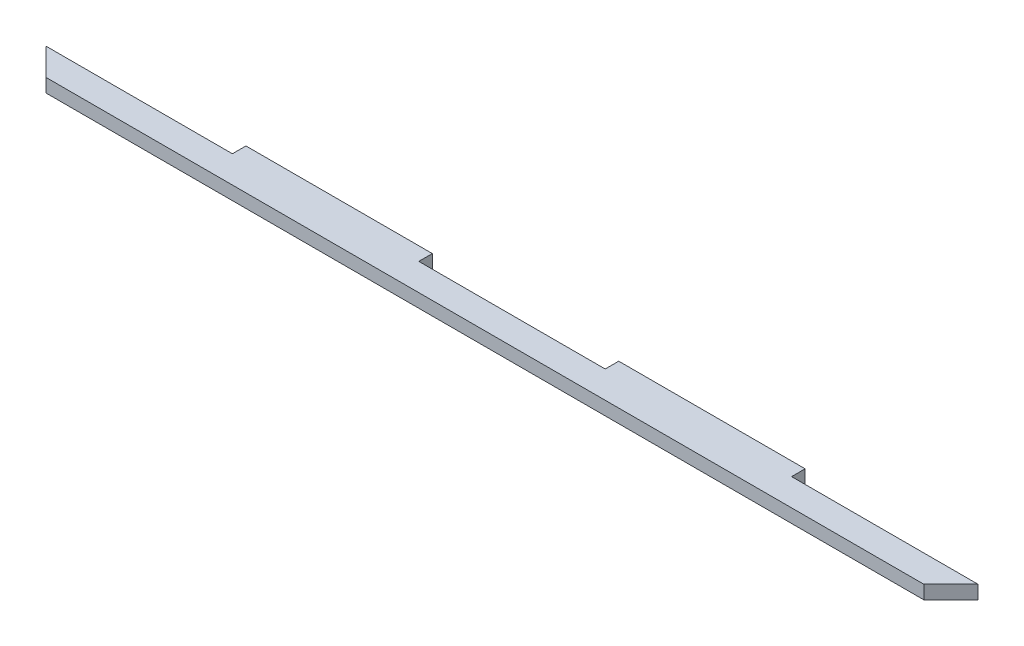
ISO-10303-21;
HEADER;
FILE_DESCRIPTION(('STEP AP214'),'2;1');
FILE_NAME('part.step','',(''),(''),'','','');
FILE_SCHEMA(('AUTOMOTIVE_DESIGN { 1 0 10303 214 1 1 1 1 }'));
ENDSEC;
DATA;
#1=APPLICATION_CONTEXT('core data for automotive mechanical design processes');
#2=APPLICATION_PROTOCOL_DEFINITION('international standard','automotive_design',2000,#1);
#3=PRODUCT_CONTEXT('',#1,'mechanical');
#4=PRODUCT('Part','Part','',(#3));
#5=PRODUCT_RELATED_PRODUCT_CATEGORY('part','',(#4));
#6=PRODUCT_DEFINITION_FORMATION('','',#4);
#7=PRODUCT_DEFINITION_CONTEXT('part definition',#1,'design');
#8=PRODUCT_DEFINITION('design','',#6,#7);
#9=PRODUCT_DEFINITION_SHAPE('','',#8);
#10=(LENGTH_UNIT() NAMED_UNIT(*) SI_UNIT(.MILLI.,.METRE.));
#11=(NAMED_UNIT(*) PLANE_ANGLE_UNIT() SI_UNIT($,.RADIAN.));
#12=(NAMED_UNIT(*) SI_UNIT($,.STERADIAN.) SOLID_ANGLE_UNIT());
#13=UNCERTAINTY_MEASURE_WITH_UNIT(LENGTH_MEASURE(1.E-05),#10,'distance_accuracy_value','');
#14=(GEOMETRIC_REPRESENTATION_CONTEXT(3) GLOBAL_UNCERTAINTY_ASSIGNED_CONTEXT((#13)) GLOBAL_UNIT_ASSIGNED_CONTEXT((#10,
#11,#12)) REPRESENTATION_CONTEXT('',''));
#15=CARTESIAN_POINT('',(0.,0.,0.));
#16=DIRECTION('',(0.,0.,1.));
#17=DIRECTION('',(1.,0.,0.));
#18=AXIS2_PLACEMENT_3D('',#15,#16,#17);
#19=CARTESIAN_POINT('',(-61.95,3.,-4.5));
#20=DIRECTION('',(1.,0.,0.));
#21=DIRECTION('',(0.,0.,-1.));
#22=AXIS2_PLACEMENT_3D('',#19,#20,#21);
#23=PLANE('',#22);
#24=DIRECTION('',(0.,0.,1.));
#25=VECTOR('',#24,1.);
#26=CARTESIAN_POINT('',(-61.95,0.,-4.5));
#27=LINE('',#26,#25);
#28=CARTESIAN_POINT('',(-61.95,0.,-4.5));
#29=VERTEX_POINT('',#28);
#30=CARTESIAN_POINT('',(-61.95,0.,-1.5));
#31=VERTEX_POINT('',#30);
#32=EDGE_CURVE('E154',#29,#31,#27,.T.);
#33=ORIENTED_EDGE('',*,*,#32,.T.);
#34=DIRECTION('',(0.,-1.,0.));
#35=VECTOR('',#34,1.);
#36=CARTESIAN_POINT('',(-61.95,3.,-1.5));
#37=LINE('',#36,#35);
#38=CARTESIAN_POINT('',(-61.95,3.,-1.5));
#39=VERTEX_POINT('',#38);
#40=EDGE_CURVE('E11',#39,#31,#37,.T.);
#41=ORIENTED_EDGE('',*,*,#40,.F.);
#42=DIRECTION('',(0.,0.,1.));
#43=VECTOR('',#42,1.);
#44=CARTESIAN_POINT('',(-61.95,3.,-4.5));
#45=LINE('',#44,#43);
#46=CARTESIAN_POINT('',(-61.95,3.,-4.5));
#47=VERTEX_POINT('',#46);
#48=EDGE_CURVE('E176',#47,#39,#45,.T.);
#49=ORIENTED_EDGE('',*,*,#48,.F.);
#50=DIRECTION('',(0.,-1.,0.));
#51=VECTOR('',#50,1.);
#52=CARTESIAN_POINT('',(-61.95,3.,-4.5));
#53=LINE('',#52,#51);
#54=EDGE_CURVE('E150',#47,#29,#53,.T.);
#55=ORIENTED_EDGE('',*,*,#54,.T.);
#56=EDGE_LOOP('',(#33,#41,#49,#55));
#57=FACE_BOUND('',#56,.T.);
#58=ADVANCED_FACE('F34',(#57),#23,.F.);
#59=CARTESIAN_POINT('',(-103.25,3.,-1.5));
#60=DIRECTION('',(0.,0.,1.));
#61=DIRECTION('',(1.,0.,0.));
#62=AXIS2_PLACEMENT_3D('',#59,#60,#61);
#63=PLANE('',#62);
#64=DIRECTION('',(-1.,0.,0.));
#65=VECTOR('',#64,1.);
#66=CARTESIAN_POINT('',(-103.25,0.,-1.5));
#67=LINE('',#66,#65);
#68=CARTESIAN_POINT('',(-103.25,0.,-1.5));
#69=VERTEX_POINT('',#68);
#70=EDGE_CURVE('E157',#31,#69,#67,.T.);
#71=ORIENTED_EDGE('',*,*,#70,.T.);
#72=DIRECTION('',(0.,-1.,0.));
#73=VECTOR('',#72,1.);
#74=CARTESIAN_POINT('',(-103.25,3.,-1.5));
#75=LINE('',#74,#73);
#76=CARTESIAN_POINT('',(-103.25,3.,-1.5));
#77=VERTEX_POINT('',#76);
#78=EDGE_CURVE('E42',#77,#69,#75,.T.);
#79=ORIENTED_EDGE('',*,*,#78,.F.);
#80=DIRECTION('',(-1.,0.,0.));
#81=VECTOR('',#80,1.);
#82=CARTESIAN_POINT('',(-103.25,3.,-1.5));
#83=LINE('',#82,#81);
#84=EDGE_CURVE('E105',#39,#77,#83,.T.);
#85=ORIENTED_EDGE('',*,*,#84,.F.);
#86=ORIENTED_EDGE('',*,*,#40,.T.);
#87=EDGE_LOOP('',(#71,#79,#85,#86));
#88=FACE_BOUND('',#87,.T.);
#89=ADVANCED_FACE('F254',(#88),#63,.F.);
#90=CARTESIAN_POINT('',(-103.25,3.,-1.5));
#91=DIRECTION('',(0.707106781186539,0.,-0.707106781186556));
#92=DIRECTION('',(-0.707106781186556,0.,-0.707106781186539));
#93=AXIS2_PLACEMENT_3D('',#90,#91,#92);
#94=PLANE('',#93);
#95=DIRECTION('',(0.707106781186556,0.,0.707106781186539));
#96=VECTOR('',#95,1.);
#97=CARTESIAN_POINT('',(-103.25,0.,-1.5));
#98=LINE('',#97,#96);
#99=CARTESIAN_POINT('',(-97.2499999999998,0.,4.5));
#100=VERTEX_POINT('',#99);
#101=EDGE_CURVE('E159',#69,#100,#98,.T.);
#102=ORIENTED_EDGE('',*,*,#101,.T.);
#103=DIRECTION('',(0.,-1.,0.));
#104=VECTOR('',#103,1.);
#105=CARTESIAN_POINT('',(-97.2499999999998,3.,4.5));
#106=LINE('',#105,#104);
#107=CARTESIAN_POINT('',(-97.2499999999998,3.,4.5));
#108=VERTEX_POINT('',#107);
#109=EDGE_CURVE('E195',#108,#100,#106,.T.);
#110=ORIENTED_EDGE('',*,*,#109,.F.);
#111=DIRECTION('',(0.707106781186556,0.,0.707106781186539));
#112=VECTOR('',#111,1.);
#113=CARTESIAN_POINT('',(-103.25,3.,-1.5));
#114=LINE('',#113,#112);
#115=EDGE_CURVE('E203',#77,#108,#114,.T.);
#116=ORIENTED_EDGE('',*,*,#115,.F.);
#117=ORIENTED_EDGE('',*,*,#78,.T.);
#118=EDGE_LOOP('',(#102,#110,#116,#117));
#119=FACE_BOUND('',#118,.T.);
#120=ADVANCED_FACE('F201',(#119),#94,.F.);
#121=CARTESIAN_POINT('',(-97.2499999999998,3.,4.5));
#122=DIRECTION('',(0.,0.,-1.));
#123=DIRECTION('',(-1.,0.,0.));
#124=AXIS2_PLACEMENT_3D('',#121,#122,#123);
#125=PLANE('',#124);
#126=DIRECTION('',(1.,0.,0.));
#127=VECTOR('',#126,1.);
#128=CARTESIAN_POINT('',(-97.2499999999998,0.,4.5));
#129=LINE('',#128,#127);
#130=CARTESIAN_POINT('',(97.2500000000001,0.,4.50000000000001));
#131=VERTEX_POINT('',#130);
#132=EDGE_CURVE('E161',#100,#131,#129,.T.);
#133=ORIENTED_EDGE('',*,*,#132,.T.);
#134=DIRECTION('',(0.,-1.,0.));
#135=VECTOR('',#134,1.);
#136=CARTESIAN_POINT('',(97.2500000000001,3.,4.50000000000001));
#137=LINE('',#136,#135);
#138=CARTESIAN_POINT('',(97.2500000000001,3.,4.50000000000001));
#139=VERTEX_POINT('',#138);
#140=EDGE_CURVE('E192',#139,#131,#137,.T.);
#141=ORIENTED_EDGE('',*,*,#140,.F.);
#142=DIRECTION('',(1.,0.,0.));
#143=VECTOR('',#142,1.);
#144=CARTESIAN_POINT('',(-97.2499999999998,3.,4.5));
#145=LINE('',#144,#143);
#146=EDGE_CURVE('E221',#108,#139,#145,.T.);
#147=ORIENTED_EDGE('',*,*,#146,.F.);
#148=ORIENTED_EDGE('',*,*,#109,.T.);
#149=EDGE_LOOP('',(#133,#141,#147,#148));
#150=FACE_BOUND('',#149,.T.);
#151=ADVANCED_FACE('F212',(#150),#125,.F.);
#152=CARTESIAN_POINT('',(103.25,3.,-1.5));
#153=DIRECTION('',(-0.707106781186551,0.,-0.707106781186544));
#154=DIRECTION('',(-0.707106781186544,0.,0.707106781186551));
#155=AXIS2_PLACEMENT_3D('',#152,#153,#154);
#156=PLANE('',#155);
#157=DIRECTION('',(0.707106781186544,0.,-0.707106781186551));
#158=VECTOR('',#157,1.);
#159=CARTESIAN_POINT('',(103.25,0.,-1.5));
#160=LINE('',#159,#158);
#161=CARTESIAN_POINT('',(103.25,0.,-1.5));
#162=VERTEX_POINT('',#161);
#163=EDGE_CURVE('E163',#131,#162,#160,.T.);
#164=ORIENTED_EDGE('',*,*,#163,.T.);
#165=DIRECTION('',(0.,-1.,0.));
#166=VECTOR('',#165,1.);
#167=CARTESIAN_POINT('',(103.25,3.,-1.5));
#168=LINE('',#167,#166);
#169=CARTESIAN_POINT('',(103.25,3.,-1.5));
#170=VERTEX_POINT('',#169);
#171=EDGE_CURVE('E189',#170,#162,#168,.T.);
#172=ORIENTED_EDGE('',*,*,#171,.F.);
#173=DIRECTION('',(0.707106781186544,0.,-0.707106781186551));
#174=VECTOR('',#173,1.);
#175=CARTESIAN_POINT('',(103.25,3.,-1.5));
#176=LINE('',#175,#174);
#177=EDGE_CURVE('E218',#139,#170,#176,.T.);
#178=ORIENTED_EDGE('',*,*,#177,.F.);
#179=ORIENTED_EDGE('',*,*,#140,.T.);
#180=EDGE_LOOP('',(#164,#172,#178,#179));
#181=FACE_BOUND('',#180,.T.);
#182=ADVANCED_FACE('F216',(#181),#156,.F.);
#183=CARTESIAN_POINT('',(61.9499999999999,3.,-1.5));
#184=DIRECTION('',(0.,0.,1.));
#185=DIRECTION('',(1.,0.,0.));
#186=AXIS2_PLACEMENT_3D('',#183,#184,#185);
#187=PLANE('',#186);
#188=DIRECTION('',(-1.,0.,0.));
#189=VECTOR('',#188,1.);
#190=CARTESIAN_POINT('',(61.9499999999999,0.,-1.5));
#191=LINE('',#190,#189);
#192=CARTESIAN_POINT('',(61.9499999999999,0.,-1.5));
#193=VERTEX_POINT('',#192);
#194=EDGE_CURVE('E165',#162,#193,#191,.T.);
#195=ORIENTED_EDGE('',*,*,#194,.T.);
#196=DIRECTION('',(0.,-1.,0.));
#197=VECTOR('',#196,1.);
#198=CARTESIAN_POINT('',(61.9499999999999,3.,-1.5));
#199=LINE('',#198,#197);
#200=CARTESIAN_POINT('',(61.9499999999999,3.,-1.5));
#201=VERTEX_POINT('',#200);
#202=EDGE_CURVE('E186',#201,#193,#199,.T.);
#203=ORIENTED_EDGE('',*,*,#202,.F.);
#204=DIRECTION('',(-1.,0.,0.));
#205=VECTOR('',#204,1.);
#206=CARTESIAN_POINT('',(61.9499999999999,3.,-1.5));
#207=LINE('',#206,#205);
#208=EDGE_CURVE('E220',#170,#201,#207,.T.);
#209=ORIENTED_EDGE('',*,*,#208,.F.);
#210=ORIENTED_EDGE('',*,*,#171,.T.);
#211=EDGE_LOOP('',(#195,#203,#209,#210));
#212=FACE_BOUND('',#211,.T.);
#213=ADVANCED_FACE('F267',(#212),#187,.F.);
#214=CARTESIAN_POINT('',(61.95,3.,-4.5));
#215=DIRECTION('',(-1.,0.,0.));
#216=DIRECTION('',(0.,0.,1.));
#217=AXIS2_PLACEMENT_3D('',#214,#215,#216);
#218=PLANE('',#217);
#219=DIRECTION('',(0.,0.,-1.));
#220=VECTOR('',#219,1.);
#221=CARTESIAN_POINT('',(61.95,0.,-4.5));
#222=LINE('',#221,#220);
#223=CARTESIAN_POINT('',(61.95,0.,-4.5));
#224=VERTEX_POINT('',#223);
#225=EDGE_CURVE('E167',#193,#224,#222,.T.);
#226=ORIENTED_EDGE('',*,*,#225,.T.);
#227=DIRECTION('',(0.,-1.,0.));
#228=VECTOR('',#227,1.);
#229=CARTESIAN_POINT('',(61.95,3.,-4.5));
#230=LINE('',#229,#228);
#231=CARTESIAN_POINT('',(61.95,3.,-4.5));
#232=VERTEX_POINT('',#231);
#233=EDGE_CURVE('E183',#232,#224,#230,.T.);
#234=ORIENTED_EDGE('',*,*,#233,.F.);
#235=DIRECTION('',(0.,0.,-1.));
#236=VECTOR('',#235,1.);
#237=CARTESIAN_POINT('',(61.95,3.,-4.5));
#238=LINE('',#237,#236);
#239=EDGE_CURVE('E223',#201,#232,#238,.T.);
#240=ORIENTED_EDGE('',*,*,#239,.F.);
#241=ORIENTED_EDGE('',*,*,#202,.T.);
#242=EDGE_LOOP('',(#226,#234,#240,#241));
#243=FACE_BOUND('',#242,.T.);
#244=ADVANCED_FACE('F270',(#243),#218,.F.);
#245=CARTESIAN_POINT('',(20.65,3.,-4.5));
#246=DIRECTION('',(0.,0.,1.));
#247=DIRECTION('',(1.,0.,0.));
#248=AXIS2_PLACEMENT_3D('',#245,#246,#247);
#249=PLANE('',#248);
#250=DIRECTION('',(-1.,0.,0.));
#251=VECTOR('',#250,1.);
#252=CARTESIAN_POINT('',(20.65,0.,-4.5));
#253=LINE('',#252,#251);
#254=CARTESIAN_POINT('',(20.65,0.,-4.5));
#255=VERTEX_POINT('',#254);
#256=EDGE_CURVE('E169',#224,#255,#253,.T.);
#257=ORIENTED_EDGE('',*,*,#256,.T.);
#258=DIRECTION('',(0.,-1.,0.));
#259=VECTOR('',#258,1.);
#260=CARTESIAN_POINT('',(20.65,3.,-4.5));
#261=LINE('',#260,#259);
#262=CARTESIAN_POINT('',(20.65,3.,-4.5));
#263=VERTEX_POINT('',#262);
#264=EDGE_CURVE('E180',#263,#255,#261,.T.);
#265=ORIENTED_EDGE('',*,*,#264,.F.);
#266=DIRECTION('',(-1.,0.,0.));
#267=VECTOR('',#266,1.);
#268=CARTESIAN_POINT('',(20.65,3.,-4.5));
#269=LINE('',#268,#267);
#270=EDGE_CURVE('E229',#232,#263,#269,.T.);
#271=ORIENTED_EDGE('',*,*,#270,.F.);
#272=ORIENTED_EDGE('',*,*,#233,.T.);
#273=EDGE_LOOP('',(#257,#265,#271,#272));
#274=FACE_BOUND('',#273,.T.);
#275=ADVANCED_FACE('F235',(#274),#249,.F.);
#276=CARTESIAN_POINT('',(20.65,3.,-4.5));
#277=DIRECTION('',(1.,0.,0.));
#278=DIRECTION('',(0.,0.,-1.));
#279=AXIS2_PLACEMENT_3D('',#276,#277,#278);
#280=PLANE('',#279);
#281=DIRECTION('',(0.,0.,1.));
#282=VECTOR('',#281,1.);
#283=CARTESIAN_POINT('',(20.65,0.,-4.5));
#284=LINE('',#283,#282);
#285=CARTESIAN_POINT('',(20.65,0.,-1.5));
#286=VERTEX_POINT('',#285);
#287=EDGE_CURVE('E171',#255,#286,#284,.T.);
#288=ORIENTED_EDGE('',*,*,#287,.T.);
#289=DIRECTION('',(0.,-1.,0.));
#290=VECTOR('',#289,1.);
#291=CARTESIAN_POINT('',(20.65,3.,-1.5));
#292=LINE('',#291,#290);
#293=CARTESIAN_POINT('',(20.65,3.,-1.5));
#294=VERTEX_POINT('',#293);
#295=EDGE_CURVE('E145',#294,#286,#292,.T.);
#296=ORIENTED_EDGE('',*,*,#295,.F.);
#297=DIRECTION('',(0.,0.,1.));
#298=VECTOR('',#297,1.);
#299=CARTESIAN_POINT('',(20.65,3.,-4.5));
#300=LINE('',#299,#298);
#301=EDGE_CURVE('E136',#263,#294,#300,.T.);
#302=ORIENTED_EDGE('',*,*,#301,.F.);
#303=ORIENTED_EDGE('',*,*,#264,.T.);
#304=EDGE_LOOP('',(#288,#296,#302,#303));
#305=FACE_BOUND('',#304,.T.);
#306=ADVANCED_FACE('F239',(#305),#280,.F.);
#307=CARTESIAN_POINT('',(-20.65,3.,-1.5));
#308=DIRECTION('',(0.,0.,1.));
#309=DIRECTION('',(1.,0.,0.));
#310=AXIS2_PLACEMENT_3D('',#307,#308,#309);
#311=PLANE('',#310);
#312=DIRECTION('',(-1.,0.,0.));
#313=VECTOR('',#312,1.);
#314=CARTESIAN_POINT('',(-20.65,0.,-1.5));
#315=LINE('',#314,#313);
#316=CARTESIAN_POINT('',(-20.65,0.,-1.5));
#317=VERTEX_POINT('',#316);
#318=EDGE_CURVE('E144',#286,#317,#315,.T.);
#319=ORIENTED_EDGE('',*,*,#318,.T.);
#320=DIRECTION('',(0.,-1.,0.));
#321=VECTOR('',#320,1.);
#322=CARTESIAN_POINT('',(-20.65,3.,-1.5));
#323=LINE('',#322,#321);
#324=CARTESIAN_POINT('',(-20.65,3.,-1.5));
#325=VERTEX_POINT('',#324);
#326=EDGE_CURVE('E141',#325,#317,#323,.T.);
#327=ORIENTED_EDGE('',*,*,#326,.F.);
#328=DIRECTION('',(-1.,0.,0.));
#329=VECTOR('',#328,1.);
#330=CARTESIAN_POINT('',(-20.65,3.,-1.5));
#331=LINE('',#330,#329);
#332=EDGE_CURVE('E130',#294,#325,#331,.T.);
#333=ORIENTED_EDGE('',*,*,#332,.F.);
#334=ORIENTED_EDGE('',*,*,#295,.T.);
#335=EDGE_LOOP('',(#319,#327,#333,#334));
#336=FACE_BOUND('',#335,.T.);
#337=ADVANCED_FACE('F142',(#336),#311,.F.);
#338=CARTESIAN_POINT('',(-20.65,3.,-4.5));
#339=DIRECTION('',(-1.,0.,0.));
#340=DIRECTION('',(0.,0.,1.));
#341=AXIS2_PLACEMENT_3D('',#338,#339,#340);
#342=PLANE('',#341);
#343=DIRECTION('',(0.,0.,-1.));
#344=VECTOR('',#343,1.);
#345=CARTESIAN_POINT('',(-20.65,0.,-4.5));
#346=LINE('',#345,#344);
#347=CARTESIAN_POINT('',(-20.65,0.,-4.5));
#348=VERTEX_POINT('',#347);
#349=EDGE_CURVE('E91',#317,#348,#346,.T.);
#350=ORIENTED_EDGE('',*,*,#349,.T.);
#351=DIRECTION('',(0.,-1.,0.));
#352=VECTOR('',#351,1.);
#353=CARTESIAN_POINT('',(-20.65,3.,-4.5));
#354=LINE('',#353,#352);
#355=CARTESIAN_POINT('',(-20.65,3.,-4.5));
#356=VERTEX_POINT('',#355);
#357=EDGE_CURVE('E146',#356,#348,#354,.T.);
#358=ORIENTED_EDGE('',*,*,#357,.F.);
#359=DIRECTION('',(0.,0.,-1.));
#360=VECTOR('',#359,1.);
#361=CARTESIAN_POINT('',(-20.65,3.,-4.5));
#362=LINE('',#361,#360);
#363=EDGE_CURVE('E134',#325,#356,#362,.T.);
#364=ORIENTED_EDGE('',*,*,#363,.F.);
#365=ORIENTED_EDGE('',*,*,#326,.T.);
#366=EDGE_LOOP('',(#350,#358,#364,#365));
#367=FACE_BOUND('',#366,.T.);
#368=ADVANCED_FACE('F148',(#367),#342,.F.);
#369=CARTESIAN_POINT('',(-61.95,3.,-4.5));
#370=DIRECTION('',(0.,0.,1.));
#371=DIRECTION('',(1.,0.,0.));
#372=AXIS2_PLACEMENT_3D('',#369,#370,#371);
#373=PLANE('',#372);
#374=DIRECTION('',(-1.,0.,0.));
#375=VECTOR('',#374,1.);
#376=CARTESIAN_POINT('',(-61.95,0.,-4.5));
#377=LINE('',#376,#375);
#378=EDGE_CURVE('E97',#348,#29,#377,.T.);
#379=ORIENTED_EDGE('',*,*,#378,.T.);
#380=ORIENTED_EDGE('',*,*,#54,.F.);
#381=DIRECTION('',(-1.,0.,0.));
#382=VECTOR('',#381,1.);
#383=CARTESIAN_POINT('',(-61.95,3.,-4.5));
#384=LINE('',#383,#382);
#385=EDGE_CURVE('E50',#356,#47,#384,.T.);
#386=ORIENTED_EDGE('',*,*,#385,.F.);
#387=ORIENTED_EDGE('',*,*,#357,.T.);
#388=EDGE_LOOP('',(#379,#380,#386,#387));
#389=FACE_BOUND('',#388,.T.);
#390=ADVANCED_FACE('F243',(#389),#373,.F.);
#391=CARTESIAN_POINT('',(0.,3.,0.));
#392=DIRECTION('',(0.,1.,0.));
#393=DIRECTION('',(0.,0.,1.));
#394=AXIS2_PLACEMENT_3D('',#391,#392,#393);
#395=PLANE('',#394);
#396=ORIENTED_EDGE('',*,*,#48,.T.);
#397=ORIENTED_EDGE('',*,*,#84,.T.);
#398=ORIENTED_EDGE('',*,*,#115,.T.);
#399=ORIENTED_EDGE('',*,*,#146,.T.);
#400=ORIENTED_EDGE('',*,*,#177,.T.);
#401=ORIENTED_EDGE('',*,*,#208,.T.);
#402=ORIENTED_EDGE('',*,*,#239,.T.);
#403=ORIENTED_EDGE('',*,*,#270,.T.);
#404=ORIENTED_EDGE('',*,*,#301,.T.);
#405=ORIENTED_EDGE('',*,*,#332,.T.);
#406=ORIENTED_EDGE('',*,*,#363,.T.);
#407=ORIENTED_EDGE('',*,*,#385,.T.);
#408=EDGE_LOOP('',(#396,#397,#398,#399,#400,#401,#402,#403,#404,#405,#406,#407));
#409=FACE_BOUND('',#408,.T.);
#410=ADVANCED_FACE('F132',(#409),#395,.T.);
#411=CARTESIAN_POINT('',(0.,0.,0.));
#412=DIRECTION('',(0.,1.,0.));
#413=DIRECTION('',(0.,0.,1.));
#414=AXIS2_PLACEMENT_3D('',#411,#412,#413);
#415=PLANE('',#414);
#416=ORIENTED_EDGE('',*,*,#32,.F.);
#417=ORIENTED_EDGE('',*,*,#378,.F.);
#418=ORIENTED_EDGE('',*,*,#349,.F.);
#419=ORIENTED_EDGE('',*,*,#318,.F.);
#420=ORIENTED_EDGE('',*,*,#287,.F.);
#421=ORIENTED_EDGE('',*,*,#256,.F.);
#422=ORIENTED_EDGE('',*,*,#225,.F.);
#423=ORIENTED_EDGE('',*,*,#194,.F.);
#424=ORIENTED_EDGE('',*,*,#163,.F.);
#425=ORIENTED_EDGE('',*,*,#132,.F.);
#426=ORIENTED_EDGE('',*,*,#101,.F.);
#427=ORIENTED_EDGE('',*,*,#70,.F.);
#428=EDGE_LOOP('',(#416,#417,#418,#419,#420,#421,#422,#423,#424,#425,#426,#427));
#429=FACE_BOUND('',#428,.T.);
#430=ADVANCED_FACE('F207',(#429),#415,.F.);
#431=CLOSED_SHELL('',(#58,#89,#120,#151,#182,#213,#244,#275,#306,#337,#368,#390,#410,#430));
#432=MANIFOLD_SOLID_BREP('B2',#431);
#433=ADVANCED_BREP_SHAPE_REPRESENTATION('',(#18,#432),#14);
#434=SHAPE_DEFINITION_REPRESENTATION(#9,#433);
ENDSEC;
END-ISO-10303-21;
